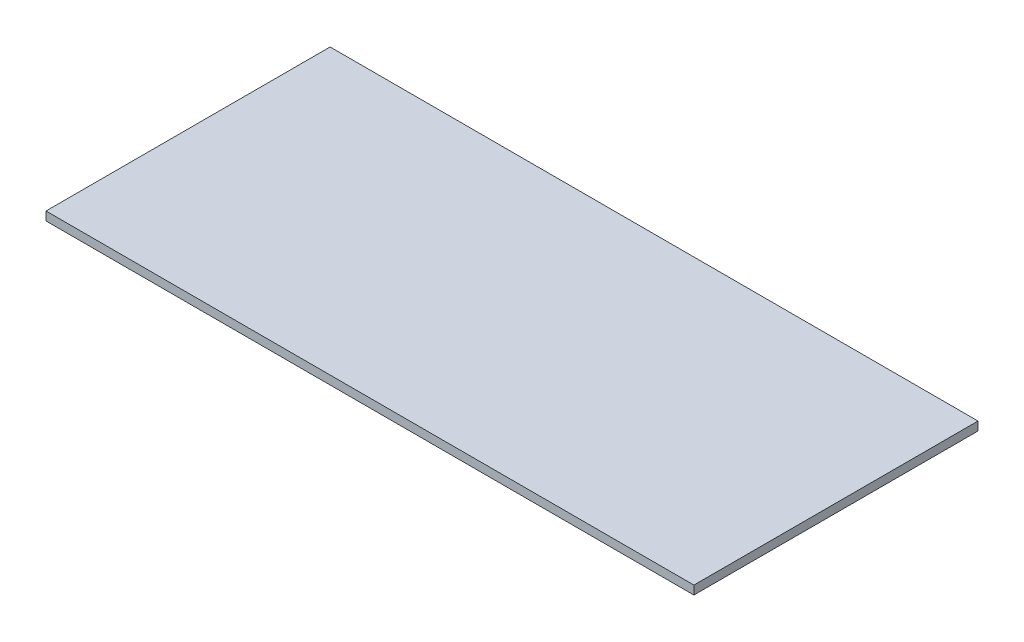
ISO-10303-21;
HEADER;
FILE_DESCRIPTION(('STEP AP214'),'2;1');
FILE_NAME('part.step','',(''),(''),'','','');
FILE_SCHEMA(('AUTOMOTIVE_DESIGN { 1 0 10303 214 1 1 1 1 }'));
ENDSEC;
DATA;
#1=APPLICATION_CONTEXT('core data for automotive mechanical design processes');
#2=APPLICATION_PROTOCOL_DEFINITION('international standard','automotive_design',2000,#1);
#3=PRODUCT_CONTEXT('',#1,'mechanical');
#4=PRODUCT('Part','Part','',(#3));
#5=PRODUCT_RELATED_PRODUCT_CATEGORY('part','',(#4));
#6=PRODUCT_DEFINITION_FORMATION('','',#4);
#7=PRODUCT_DEFINITION_CONTEXT('part definition',#1,'design');
#8=PRODUCT_DEFINITION('design','',#6,#7);
#9=PRODUCT_DEFINITION_SHAPE('','',#8);
#10=(LENGTH_UNIT() NAMED_UNIT(*) SI_UNIT(.MILLI.,.METRE.));
#11=(NAMED_UNIT(*) PLANE_ANGLE_UNIT() SI_UNIT($,.RADIAN.));
#12=(NAMED_UNIT(*) SI_UNIT($,.STERADIAN.) SOLID_ANGLE_UNIT());
#13=UNCERTAINTY_MEASURE_WITH_UNIT(LENGTH_MEASURE(1.E-05),#10,'distance_accuracy_value','');
#14=(GEOMETRIC_REPRESENTATION_CONTEXT(3) GLOBAL_UNCERTAINTY_ASSIGNED_CONTEXT((#13)) GLOBAL_UNIT_ASSIGNED_CONTEXT((#10,
#11,#12)) REPRESENTATION_CONTEXT('',''));
#15=CARTESIAN_POINT('',(0.,0.,0.));
#16=DIRECTION('',(0.,0.,1.));
#17=DIRECTION('',(1.,0.,0.));
#18=AXIS2_PLACEMENT_3D('',#15,#16,#17);
#19=CARTESIAN_POINT('',(0.,1.5875,0.));
#20=DIRECTION('',(1.,0.,0.));
#21=DIRECTION('',(0.,0.,-1.));
#22=AXIS2_PLACEMENT_3D('',#19,#20,#21);
#23=PLANE('',#22);
#24=DIRECTION('',(0.,0.,1.));
#25=VECTOR('',#24,1.);
#26=CARTESIAN_POINT('',(0.,0.,0.));
#27=LINE('',#26,#25);
#28=CARTESIAN_POINT('',(0.,0.,-52.07));
#29=VERTEX_POINT('',#28);
#30=CARTESIAN_POINT('',(0.,0.,0.));
#31=VERTEX_POINT('',#30);
#32=EDGE_CURVE('E96',#29,#31,#27,.T.);
#33=ORIENTED_EDGE('',*,*,#32,.T.);
#34=DIRECTION('',(0.,-1.,0.));
#35=VECTOR('',#34,1.);
#36=CARTESIAN_POINT('',(0.,1.5875,0.));
#37=LINE('',#36,#35);
#38=CARTESIAN_POINT('',(0.,1.5875,0.));
#39=VERTEX_POINT('',#38);
#40=EDGE_CURVE('E11',#39,#31,#37,.T.);
#41=ORIENTED_EDGE('',*,*,#40,.F.);
#42=DIRECTION('',(0.,0.,1.));
#43=VECTOR('',#42,1.);
#44=CARTESIAN_POINT('',(0.,1.5875,0.));
#45=LINE('',#44,#43);
#46=CARTESIAN_POINT('',(0.,1.5875,-52.07));
#47=VERTEX_POINT('',#46);
#48=EDGE_CURVE('E84',#47,#39,#45,.T.);
#49=ORIENTED_EDGE('',*,*,#48,.F.);
#50=DIRECTION('',(0.,-1.,0.));
#51=VECTOR('',#50,1.);
#52=CARTESIAN_POINT('',(0.,1.5875,-52.07));
#53=LINE('',#52,#51);
#54=EDGE_CURVE('E92',#47,#29,#53,.T.);
#55=ORIENTED_EDGE('',*,*,#54,.T.);
#56=EDGE_LOOP('',(#33,#41,#49,#55));
#57=FACE_BOUND('',#56,.T.);
#58=ADVANCED_FACE('F33',(#57),#23,.F.);
#59=CARTESIAN_POINT('',(0.,1.5875,0.));
#60=DIRECTION('',(0.,0.,-1.));
#61=DIRECTION('',(-1.,0.,0.));
#62=AXIS2_PLACEMENT_3D('',#59,#60,#61);
#63=PLANE('',#62);
#64=DIRECTION('',(1.,0.,0.));
#65=VECTOR('',#64,1.);
#66=CARTESIAN_POINT('',(0.,0.,0.));
#67=LINE('',#66,#65);
#68=CARTESIAN_POINT('',(118.745,0.,0.));
#69=VERTEX_POINT('',#68);
#70=EDGE_CURVE('E88',#31,#69,#67,.T.);
#71=ORIENTED_EDGE('',*,*,#70,.T.);
#72=DIRECTION('',(0.,-1.,0.));
#73=VECTOR('',#72,1.);
#74=CARTESIAN_POINT('',(118.745,1.5875,0.));
#75=LINE('',#74,#73);
#76=CARTESIAN_POINT('',(118.745,1.5875,0.));
#77=VERTEX_POINT('',#76);
#78=EDGE_CURVE('E41',#77,#69,#75,.T.);
#79=ORIENTED_EDGE('',*,*,#78,.F.);
#80=DIRECTION('',(1.,0.,0.));
#81=VECTOR('',#80,1.);
#82=CARTESIAN_POINT('',(0.,1.5875,0.));
#83=LINE('',#82,#81);
#84=EDGE_CURVE('E79',#39,#77,#83,.T.);
#85=ORIENTED_EDGE('',*,*,#84,.F.);
#86=ORIENTED_EDGE('',*,*,#40,.T.);
#87=EDGE_LOOP('',(#71,#79,#85,#86));
#88=FACE_BOUND('',#87,.T.);
#89=ADVANCED_FACE('F87',(#88),#63,.F.);
#90=CARTESIAN_POINT('',(118.745,1.5875,0.));
#91=DIRECTION('',(-1.,0.,0.));
#92=DIRECTION('',(0.,0.,1.));
#93=AXIS2_PLACEMENT_3D('',#90,#91,#92);
#94=PLANE('',#93);
#95=DIRECTION('',(0.,0.,-1.));
#96=VECTOR('',#95,1.);
#97=CARTESIAN_POINT('',(118.745,0.,0.));
#98=LINE('',#97,#96);
#99=CARTESIAN_POINT('',(118.745,0.,-52.07));
#100=VERTEX_POINT('',#99);
#101=EDGE_CURVE('E66',#69,#100,#98,.T.);
#102=ORIENTED_EDGE('',*,*,#101,.T.);
#103=DIRECTION('',(0.,-1.,0.));
#104=VECTOR('',#103,1.);
#105=CARTESIAN_POINT('',(118.745,1.5875,-52.07));
#106=LINE('',#105,#104);
#107=CARTESIAN_POINT('',(118.745,1.5875,-52.07));
#108=VERTEX_POINT('',#107);
#109=EDGE_CURVE('E89',#108,#100,#106,.T.);
#110=ORIENTED_EDGE('',*,*,#109,.F.);
#111=DIRECTION('',(0.,0.,-1.));
#112=VECTOR('',#111,1.);
#113=CARTESIAN_POINT('',(118.745,1.5875,0.));
#114=LINE('',#113,#112);
#115=EDGE_CURVE('E82',#77,#108,#114,.T.);
#116=ORIENTED_EDGE('',*,*,#115,.F.);
#117=ORIENTED_EDGE('',*,*,#78,.T.);
#118=EDGE_LOOP('',(#102,#110,#116,#117));
#119=FACE_BOUND('',#118,.T.);
#120=ADVANCED_FACE('F90',(#119),#94,.F.);
#121=CARTESIAN_POINT('',(0.,1.5875,-52.07));
#122=DIRECTION('',(0.,0.,1.));
#123=DIRECTION('',(1.,0.,0.));
#124=AXIS2_PLACEMENT_3D('',#121,#122,#123);
#125=PLANE('',#124);
#126=DIRECTION('',(-1.,0.,0.));
#127=VECTOR('',#126,1.);
#128=CARTESIAN_POINT('',(0.,0.,-52.07));
#129=LINE('',#128,#127);
#130=EDGE_CURVE('E72',#100,#29,#129,.T.);
#131=ORIENTED_EDGE('',*,*,#130,.T.);
#132=ORIENTED_EDGE('',*,*,#54,.F.);
#133=DIRECTION('',(-1.,0.,0.));
#134=VECTOR('',#133,1.);
#135=CARTESIAN_POINT('',(0.,1.5875,-52.07));
#136=LINE('',#135,#134);
#137=EDGE_CURVE('E49',#108,#47,#136,.T.);
#138=ORIENTED_EDGE('',*,*,#137,.F.);
#139=ORIENTED_EDGE('',*,*,#109,.T.);
#140=EDGE_LOOP('',(#131,#132,#138,#139));
#141=FACE_BOUND('',#140,.T.);
#142=ADVANCED_FACE('F103',(#141),#125,.F.);
#143=CARTESIAN_POINT('',(0.,1.5875,-52.07));
#144=DIRECTION('',(0.,-1.,0.));
#145=DIRECTION('',(0.,0.,-1.));
#146=AXIS2_PLACEMENT_3D('',#143,#144,#145);
#147=PLANE('',#146);
#148=ORIENTED_EDGE('',*,*,#48,.T.);
#149=ORIENTED_EDGE('',*,*,#84,.T.);
#150=ORIENTED_EDGE('',*,*,#115,.T.);
#151=ORIENTED_EDGE('',*,*,#137,.T.);
#152=EDGE_LOOP('',(#148,#149,#150,#151));
#153=FACE_BOUND('',#152,.T.);
#154=ADVANCED_FACE('F80',(#153),#147,.F.);
#155=CARTESIAN_POINT('',(0.,0.,-52.07));
#156=DIRECTION('',(0.,-1.,0.));
#157=DIRECTION('',(0.,0.,-1.));
#158=AXIS2_PLACEMENT_3D('',#155,#156,#157);
#159=PLANE('',#158);
#160=ORIENTED_EDGE('',*,*,#32,.F.);
#161=ORIENTED_EDGE('',*,*,#130,.F.);
#162=ORIENTED_EDGE('',*,*,#101,.F.);
#163=ORIENTED_EDGE('',*,*,#70,.F.);
#164=EDGE_LOOP('',(#160,#161,#162,#163));
#165=FACE_BOUND('',#164,.T.);
#166=ADVANCED_FACE('F106',(#165),#159,.T.);
#167=CLOSED_SHELL('',(#58,#89,#120,#142,#154,#166));
#168=MANIFOLD_SOLID_BREP('B2',#167);
#169=ADVANCED_BREP_SHAPE_REPRESENTATION('',(#18,#168),#14);
#170=SHAPE_DEFINITION_REPRESENTATION(#9,#169);
ENDSEC;
END-ISO-10303-21;
